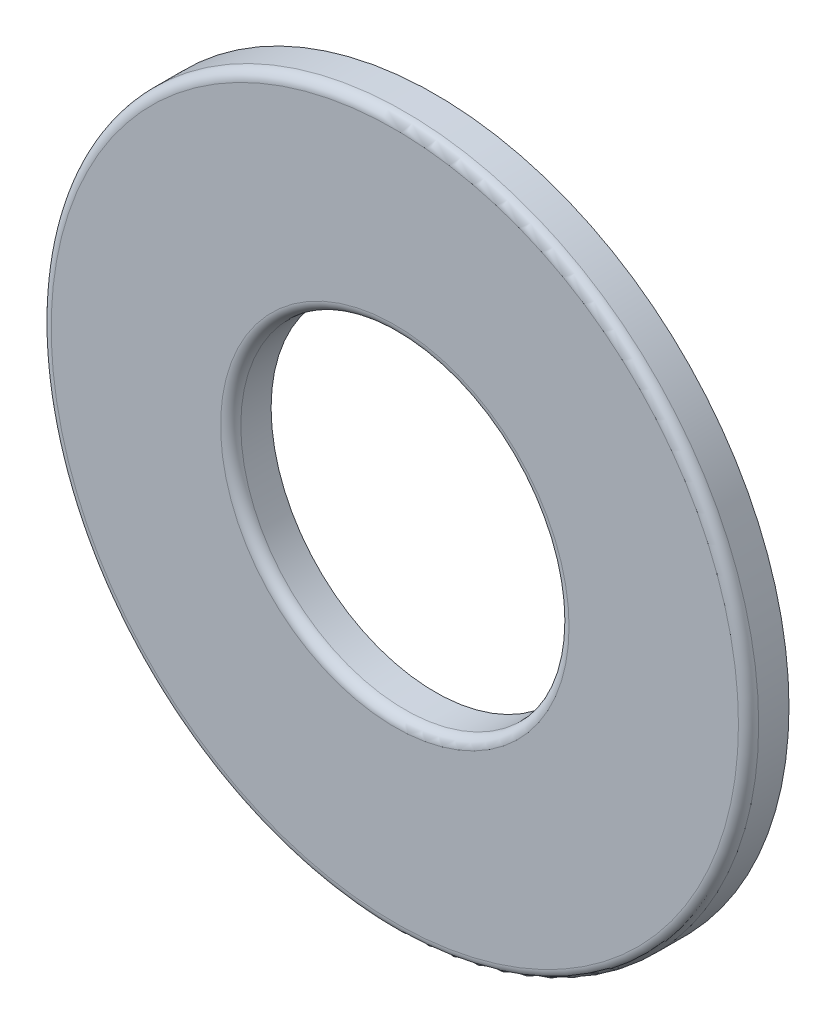
ISO-10303-21;
HEADER;
FILE_DESCRIPTION(('STEP AP214'),'2;1');
FILE_NAME('part.step','',(''),(''),'','','');
FILE_SCHEMA(('AUTOMOTIVE_DESIGN { 1 0 10303 214 1 1 1 1 }'));
ENDSEC;
DATA;
#1=APPLICATION_CONTEXT('core data for automotive mechanical design processes');
#2=APPLICATION_PROTOCOL_DEFINITION('international standard','automotive_design',2000,#1);
#3=PRODUCT_CONTEXT('',#1,'mechanical');
#4=PRODUCT('Part','Part','',(#3));
#5=PRODUCT_RELATED_PRODUCT_CATEGORY('part','',(#4));
#6=PRODUCT_DEFINITION_FORMATION('','',#4);
#7=PRODUCT_DEFINITION_CONTEXT('part definition',#1,'design');
#8=PRODUCT_DEFINITION('design','',#6,#7);
#9=PRODUCT_DEFINITION_SHAPE('','',#8);
#10=(LENGTH_UNIT() NAMED_UNIT(*) SI_UNIT(.MILLI.,.METRE.));
#11=(NAMED_UNIT(*) PLANE_ANGLE_UNIT() SI_UNIT($,.RADIAN.));
#12=(NAMED_UNIT(*) SI_UNIT($,.STERADIAN.) SOLID_ANGLE_UNIT());
#13=UNCERTAINTY_MEASURE_WITH_UNIT(LENGTH_MEASURE(1.E-05),#10,'distance_accuracy_value','');
#14=(GEOMETRIC_REPRESENTATION_CONTEXT(3) GLOBAL_UNCERTAINTY_ASSIGNED_CONTEXT((#13)) GLOBAL_UNIT_ASSIGNED_CONTEXT((#10,
#11,#12)) REPRESENTATION_CONTEXT('',''));
#15=CARTESIAN_POINT('',(0.,0.,0.));
#16=DIRECTION('',(0.,0.,1.));
#17=DIRECTION('',(1.,0.,0.));
#18=AXIS2_PLACEMENT_3D('',#15,#16,#17);
#19=CARTESIAN_POINT('',(0.,0.,0.634999999999998));
#20=DIRECTION('',(0.,0.,1.));
#21=DIRECTION('',(1.,0.,0.));
#22=AXIS2_PLACEMENT_3D('',#19,#20,#21);
#23=PLANE('',#22);
#24=CARTESIAN_POINT('',(0.,0.,0.634999999999998));
#25=DIRECTION('',(0.,0.,1.));
#26=DIRECTION('',(1.,0.,0.));
#27=AXIS2_PLACEMENT_3D('',#24,#25,#26);
#28=CIRCLE('',#27,10.795);
#29=CARTESIAN_POINT('',(10.795,0.,0.634999999999998));
#30=VERTEX_POINT('',#29);
#31=EDGE_CURVE('E48',#30,#30,#28,.T.);
#32=ORIENTED_EDGE('',*,*,#31,.T.);
#33=EDGE_LOOP('',(#32));
#34=FACE_BOUND('',#33,.T.);
#35=CARTESIAN_POINT('',(0.,0.,0.634999999999998));
#36=DIRECTION('',(0.,0.,1.));
#37=DIRECTION('',(1.,0.,0.));
#38=AXIS2_PLACEMENT_3D('',#35,#36,#37);
#39=CIRCLE('',#38,5.4737);
#40=CARTESIAN_POINT('',(5.4737,0.,0.634999999999998));
#41=VERTEX_POINT('',#40);
#42=EDGE_CURVE('E52',#41,#41,#39,.F.);
#43=ORIENTED_EDGE('',*,*,#42,.T.);
#44=EDGE_LOOP('',(#43));
#45=FACE_BOUND('',#44,.T.);
#46=ADVANCED_FACE('F37',(#34,#45),#23,.T.);
#47=CARTESIAN_POINT('',(0.,0.,0.634999999999998));
#48=DIRECTION('',(0.,0.,-1.));
#49=DIRECTION('',(-1.,0.,0.));
#50=AXIS2_PLACEMENT_3D('',#47,#48,#49);
#51=CYLINDRICAL_SURFACE('',#50,11.1125);
#52=CARTESIAN_POINT('',(0.,0.,0.317499999999998));
#53=DIRECTION('',(0.,0.,1.));
#54=DIRECTION('',(1.,0.,0.));
#55=AXIS2_PLACEMENT_3D('',#52,#53,#54);
#56=CIRCLE('',#55,11.1125);
#57=CARTESIAN_POINT('',(11.1125,0.,0.317499999999998));
#58=VERTEX_POINT('',#57);
#59=EDGE_CURVE('E44',#58,#58,#56,.F.);
#60=ORIENTED_EDGE('',*,*,#59,.T.);
#61=EDGE_LOOP('',(#60));
#62=FACE_BOUND('',#61,.T.);
#63=CARTESIAN_POINT('',(0.,0.,-0.635000000000002));
#64=DIRECTION('',(0.,0.,1.));
#65=DIRECTION('',(1.,0.,0.));
#66=AXIS2_PLACEMENT_3D('',#63,#64,#65);
#67=CIRCLE('',#66,11.1125);
#68=CARTESIAN_POINT('',(11.1125,0.,-0.635000000000002));
#69=VERTEX_POINT('',#68);
#70=EDGE_CURVE('E57',#69,#69,#67,.T.);
#71=ORIENTED_EDGE('',*,*,#70,.T.);
#72=EDGE_LOOP('',(#71));
#73=FACE_BOUND('',#72,.T.);
#74=ADVANCED_FACE('F69',(#62,#73),#51,.T.);
#75=CARTESIAN_POINT('',(0.,0.,0.634999999999998));
#76=DIRECTION('',(0.,0.,-1.));
#77=DIRECTION('',(-1.,0.,0.));
#78=AXIS2_PLACEMENT_3D('',#75,#76,#77);
#79=CYLINDRICAL_SURFACE('',#78,5.1562);
#80=CARTESIAN_POINT('',(0.,0.,0.317499999999998));
#81=DIRECTION('',(0.,0.,1.));
#82=DIRECTION('',(1.,0.,0.));
#83=AXIS2_PLACEMENT_3D('',#80,#81,#82);
#84=CIRCLE('',#83,5.1562);
#85=CARTESIAN_POINT('',(5.1562,0.,0.317499999999998));
#86=VERTEX_POINT('',#85);
#87=EDGE_CURVE('E10',#86,#86,#84,.T.);
#88=ORIENTED_EDGE('',*,*,#87,.T.);
#89=EDGE_LOOP('',(#88));
#90=FACE_BOUND('',#89,.T.);
#91=CARTESIAN_POINT('',(0.,0.,-0.635000000000002));
#92=DIRECTION('',(0.,0.,1.));
#93=DIRECTION('',(1.,0.,0.));
#94=AXIS2_PLACEMENT_3D('',#91,#92,#93);
#95=CIRCLE('',#94,5.1562);
#96=CARTESIAN_POINT('',(5.1562,0.,-0.635000000000002));
#97=VERTEX_POINT('',#96);
#98=EDGE_CURVE('E60',#97,#97,#95,.T.);
#99=ORIENTED_EDGE('',*,*,#98,.F.);
#100=EDGE_LOOP('',(#99));
#101=FACE_BOUND('',#100,.T.);
#102=ADVANCED_FACE('F67',(#90,#101),#79,.F.);
#103=CARTESIAN_POINT('',(0.,0.,-0.635000000000002));
#104=DIRECTION('',(0.,0.,1.));
#105=DIRECTION('',(1.,0.,0.));
#106=AXIS2_PLACEMENT_3D('',#103,#104,#105);
#107=PLANE('',#106);
#108=ORIENTED_EDGE('',*,*,#98,.T.);
#109=EDGE_LOOP('',(#108));
#110=FACE_BOUND('',#109,.T.);
#111=ORIENTED_EDGE('',*,*,#70,.F.);
#112=EDGE_LOOP('',(#111));
#113=FACE_BOUND('',#112,.T.);
#114=ADVANCED_FACE('F64',(#110,#113),#107,.F.);
#115=CARTESIAN_POINT('',(0.,0.,0.317499999999998));
#116=DIRECTION('',(0.,0.,1.));
#117=DIRECTION('',(1.,0.,0.));
#118=AXIS2_PLACEMENT_3D('',#115,#116,#117);
#119=TOROIDAL_SURFACE('',#118,10.795,0.3175);
#120=ORIENTED_EDGE('',*,*,#59,.F.);
#121=EDGE_LOOP('',(#120));
#122=FACE_BOUND('',#121,.T.);
#123=ORIENTED_EDGE('',*,*,#31,.F.);
#124=EDGE_LOOP('',(#123));
#125=FACE_BOUND('',#124,.T.);
#126=ADVANCED_FACE('F76',(#122,#125),#119,.T.);
#127=CARTESIAN_POINT('',(0.,0.,0.317499999999998));
#128=DIRECTION('',(0.,0.,1.));
#129=DIRECTION('',(1.,0.,0.));
#130=AXIS2_PLACEMENT_3D('',#127,#128,#129);
#131=TOROIDAL_SURFACE('',#130,5.4737,0.3175);
#132=ORIENTED_EDGE('',*,*,#42,.F.);
#133=EDGE_LOOP('',(#132));
#134=FACE_BOUND('',#133,.T.);
#135=ORIENTED_EDGE('',*,*,#87,.F.);
#136=EDGE_LOOP('',(#135));
#137=FACE_BOUND('',#136,.T.);
#138=ADVANCED_FACE('F39',(#134,#137),#131,.T.);
#139=CLOSED_SHELL('',(#46,#74,#102,#114,#126,#138));
#140=MANIFOLD_SOLID_BREP('B2',#139);
#141=ADVANCED_BREP_SHAPE_REPRESENTATION('',(#18,#140),#14);
#142=SHAPE_DEFINITION_REPRESENTATION(#9,#141);
ENDSEC;
END-ISO-10303-21;
